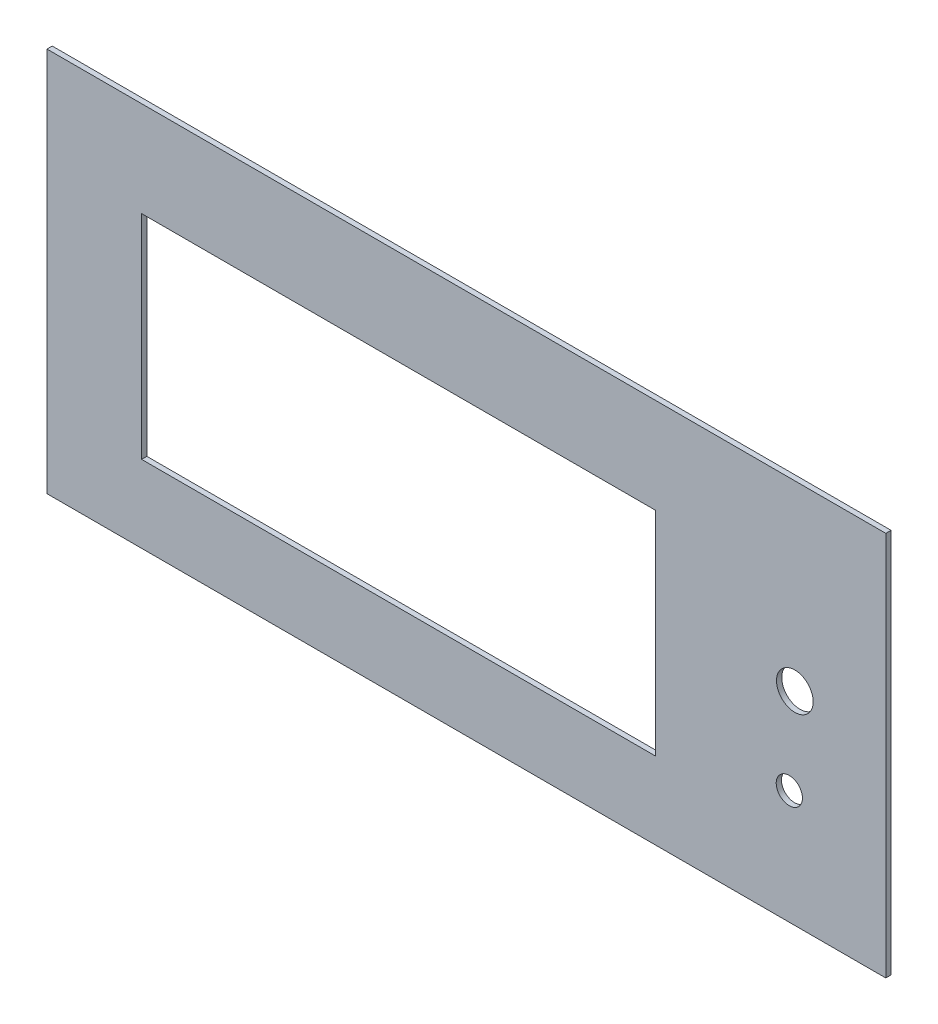
ISO-10303-21;
HEADER;
FILE_DESCRIPTION(('STEP AP214'),'2;1');
FILE_NAME('part.step','',(''),(''),'','','');
FILE_SCHEMA(('AUTOMOTIVE_DESIGN { 1 0 10303 214 1 1 1 1 }'));
ENDSEC;
DATA;
#1=APPLICATION_CONTEXT('core data for automotive mechanical design processes');
#2=APPLICATION_PROTOCOL_DEFINITION('international standard','automotive_design',2000,#1);
#3=PRODUCT_CONTEXT('',#1,'mechanical');
#4=PRODUCT('Part','Part','',(#3));
#5=PRODUCT_RELATED_PRODUCT_CATEGORY('part','',(#4));
#6=PRODUCT_DEFINITION_FORMATION('','',#4);
#7=PRODUCT_DEFINITION_CONTEXT('part definition',#1,'design');
#8=PRODUCT_DEFINITION('design','',#6,#7);
#9=PRODUCT_DEFINITION_SHAPE('','',#8);
#10=(LENGTH_UNIT() NAMED_UNIT(*) SI_UNIT(.MILLI.,.METRE.));
#11=(NAMED_UNIT(*) PLANE_ANGLE_UNIT() SI_UNIT($,.RADIAN.));
#12=(NAMED_UNIT(*) SI_UNIT($,.STERADIAN.) SOLID_ANGLE_UNIT());
#13=UNCERTAINTY_MEASURE_WITH_UNIT(LENGTH_MEASURE(1.E-05),#10,'distance_accuracy_value','');
#14=(GEOMETRIC_REPRESENTATION_CONTEXT(3) GLOBAL_UNCERTAINTY_ASSIGNED_CONTEXT((#13)) GLOBAL_UNIT_ASSIGNED_CONTEXT((#10,
#11,#12)) REPRESENTATION_CONTEXT('',''));
#15=CARTESIAN_POINT('',(0.,0.,0.));
#16=DIRECTION('',(0.,0.,1.));
#17=DIRECTION('',(1.,0.,0.));
#18=AXIS2_PLACEMENT_3D('',#15,#16,#17);
#19=CARTESIAN_POINT('',(0.,0.,1.));
#20=DIRECTION('',(0.,0.,1.));
#21=DIRECTION('',(1.,0.,0.));
#22=AXIS2_PLACEMENT_3D('',#19,#20,#21);
#23=PLANE('',#22);
#24=CARTESIAN_POINT('',(62.146139268792,-19.245198342134,1.));
#25=DIRECTION('',(0.,0.,1.));
#26=DIRECTION('',(1.,0.,0.));
#27=AXIS2_PLACEMENT_3D('',#24,#25,#26);
#28=CIRCLE('',#27,2.5);
#29=CARTESIAN_POINT('',(64.646139268792,-19.245198342134,1.));
#30=VERTEX_POINT('',#29);
#31=EDGE_CURVE('E145',#30,#30,#28,.T.);
#32=ORIENTED_EDGE('',*,*,#31,.F.);
#33=EDGE_LOOP('',(#32));
#34=FACE_BOUND('',#33,.T.);
#35=DIRECTION('',(0.,-1.,0.));
#36=VECTOR('',#35,1.);
#37=CARTESIAN_POINT('',(-79.453860731208,32.454801657866,1.));
#38=LINE('',#37,#36);
#39=CARTESIAN_POINT('',(-79.453860731208,32.454801657866,1.));
#40=VERTEX_POINT('',#39);
#41=CARTESIAN_POINT('',(-79.453860731208,-41.,1.));
#42=VERTEX_POINT('',#41);
#43=EDGE_CURVE('E155',#40,#42,#38,.T.);
#44=ORIENTED_EDGE('',*,*,#43,.T.);
#45=DIRECTION('',(1.,0.,0.));
#46=VECTOR('',#45,1.);
#47=CARTESIAN_POINT('',(-79.453860731208,-41.,1.));
#48=LINE('',#47,#46);
#49=CARTESIAN_POINT('',(80.546139268792,-41.,1.));
#50=VERTEX_POINT('',#49);
#51=EDGE_CURVE('E158',#42,#50,#48,.T.);
#52=ORIENTED_EDGE('',*,*,#51,.T.);
#53=DIRECTION('',(0.,1.,0.));
#54=VECTOR('',#53,1.);
#55=CARTESIAN_POINT('',(80.546139268792,-41.,1.));
#56=LINE('',#55,#54);
#57=CARTESIAN_POINT('',(80.546139268792,32.454801657866,1.));
#58=VERTEX_POINT('',#57);
#59=EDGE_CURVE('E161',#50,#58,#56,.T.);
#60=ORIENTED_EDGE('',*,*,#59,.T.);
#61=DIRECTION('',(-1.,0.,0.));
#62=VECTOR('',#61,1.);
#63=CARTESIAN_POINT('',(80.546139268792,32.454801657866,1.));
#64=LINE('',#63,#62);
#65=EDGE_CURVE('E163',#58,#40,#64,.T.);
#66=ORIENTED_EDGE('',*,*,#65,.T.);
#67=EDGE_LOOP('',(#44,#52,#60,#66));
#68=FACE_BOUND('',#67,.T.);
#69=DIRECTION('',(1.,0.,0.));
#70=VECTOR('',#69,1.);
#71=CARTESIAN_POINT('',(-61.4,-26.3,1.));
#72=LINE('',#71,#70);
#73=CARTESIAN_POINT('',(-61.4,-26.3,1.));
#74=VERTEX_POINT('',#73);
#75=CARTESIAN_POINT('',(36.6,-26.3,1.));
#76=VERTEX_POINT('',#75);
#77=EDGE_CURVE('E124',#74,#76,#72,.T.);
#78=ORIENTED_EDGE('',*,*,#77,.F.);
#79=DIRECTION('',(0.,-1.,0.));
#80=VECTOR('',#79,1.);
#81=CARTESIAN_POINT('',(-61.4,14.3,1.));
#82=LINE('',#81,#80);
#83=CARTESIAN_POINT('',(-61.4,14.3,1.));
#84=VERTEX_POINT('',#83);
#85=EDGE_CURVE('E116',#84,#74,#82,.T.);
#86=ORIENTED_EDGE('',*,*,#85,.F.);
#87=DIRECTION('',(-1.,0.,0.));
#88=VECTOR('',#87,1.);
#89=CARTESIAN_POINT('',(36.6,14.3,1.));
#90=LINE('',#89,#88);
#91=CARTESIAN_POINT('',(36.6,14.3,1.));
#92=VERTEX_POINT('',#91);
#93=EDGE_CURVE('E139',#92,#84,#90,.T.);
#94=ORIENTED_EDGE('',*,*,#93,.F.);
#95=DIRECTION('',(0.,1.,0.));
#96=VECTOR('',#95,1.);
#97=CARTESIAN_POINT('',(36.6,-26.3,1.));
#98=LINE('',#97,#96);
#99=EDGE_CURVE('E137',#76,#92,#98,.T.);
#100=ORIENTED_EDGE('',*,*,#99,.F.);
#101=EDGE_LOOP('',(#78,#86,#94,#100));
#102=FACE_BOUND('',#101,.T.);
#103=CARTESIAN_POINT('',(63.196139268792,-2.295198342134,1.));
#104=DIRECTION('',(0.,0.,1.));
#105=DIRECTION('',(1.,0.,0.));
#106=AXIS2_PLACEMENT_3D('',#103,#104,#105);
#107=CIRCLE('',#106,3.50000000000001);
#108=CARTESIAN_POINT('',(66.696139268792,-2.295198342134,1.));
#109=VERTEX_POINT('',#108);
#110=EDGE_CURVE('E245',#109,#109,#107,.T.);
#111=ORIENTED_EDGE('',*,*,#110,.F.);
#112=EDGE_LOOP('',(#111));
#113=FACE_BOUND('',#112,.T.);
#114=ADVANCED_FACE('F51',(#34,#68,#102,#113),#23,.T.);
#115=CARTESIAN_POINT('',(0.,0.,0.));
#116=DIRECTION('',(0.,0.,1.));
#117=DIRECTION('',(1.,0.,0.));
#118=AXIS2_PLACEMENT_3D('',#115,#116,#117);
#119=PLANE('',#118);
#120=DIRECTION('',(0.,-1.,0.));
#121=VECTOR('',#120,1.);
#122=CARTESIAN_POINT('',(-79.453860731208,32.454801657866,0.));
#123=LINE('',#122,#121);
#124=CARTESIAN_POINT('',(-79.453860731208,32.454801657866,0.));
#125=VERTEX_POINT('',#124);
#126=CARTESIAN_POINT('',(-79.453860731208,-41.,0.));
#127=VERTEX_POINT('',#126);
#128=EDGE_CURVE('E132',#125,#127,#123,.T.);
#129=ORIENTED_EDGE('',*,*,#128,.F.);
#130=DIRECTION('',(-1.,0.,0.));
#131=VECTOR('',#130,1.);
#132=CARTESIAN_POINT('',(80.546139268792,32.454801657866,0.));
#133=LINE('',#132,#131);
#134=CARTESIAN_POINT('',(80.546139268792,32.454801657866,0.));
#135=VERTEX_POINT('',#134);
#136=EDGE_CURVE('E159',#135,#125,#133,.T.);
#137=ORIENTED_EDGE('',*,*,#136,.F.);
#138=DIRECTION('',(0.,1.,0.));
#139=VECTOR('',#138,1.);
#140=CARTESIAN_POINT('',(80.546139268792,-41.,0.));
#141=LINE('',#140,#139);
#142=CARTESIAN_POINT('',(80.546139268792,-41.,0.));
#143=VERTEX_POINT('',#142);
#144=EDGE_CURVE('E170',#143,#135,#141,.T.);
#145=ORIENTED_EDGE('',*,*,#144,.F.);
#146=DIRECTION('',(1.,0.,0.));
#147=VECTOR('',#146,1.);
#148=CARTESIAN_POINT('',(-79.453860731208,-41.,0.));
#149=LINE('',#148,#147);
#150=EDGE_CURVE('E168',#127,#143,#149,.T.);
#151=ORIENTED_EDGE('',*,*,#150,.F.);
#152=EDGE_LOOP('',(#129,#137,#145,#151));
#153=FACE_BOUND('',#152,.T.);
#154=DIRECTION('',(0.,-1.,0.));
#155=VECTOR('',#154,1.);
#156=CARTESIAN_POINT('',(-61.4,14.3,0.));
#157=LINE('',#156,#155);
#158=CARTESIAN_POINT('',(-61.4,14.3,0.));
#159=VERTEX_POINT('',#158);
#160=CARTESIAN_POINT('',(-61.4,-26.3,0.));
#161=VERTEX_POINT('',#160);
#162=EDGE_CURVE('E74',#159,#161,#157,.T.);
#163=ORIENTED_EDGE('',*,*,#162,.T.);
#164=DIRECTION('',(1.,0.,0.));
#165=VECTOR('',#164,1.);
#166=CARTESIAN_POINT('',(-61.4,-26.3,0.));
#167=LINE('',#166,#165);
#168=CARTESIAN_POINT('',(36.6,-26.3,0.));
#169=VERTEX_POINT('',#168);
#170=EDGE_CURVE('E131',#161,#169,#167,.T.);
#171=ORIENTED_EDGE('',*,*,#170,.T.);
#172=DIRECTION('',(0.,1.,0.));
#173=VECTOR('',#172,1.);
#174=CARTESIAN_POINT('',(36.6,-26.3,0.));
#175=LINE('',#174,#173);
#176=CARTESIAN_POINT('',(36.6,14.3,0.));
#177=VERTEX_POINT('',#176);
#178=EDGE_CURVE('E147',#169,#177,#175,.T.);
#179=ORIENTED_EDGE('',*,*,#178,.T.);
#180=DIRECTION('',(-1.,0.,0.));
#181=VECTOR('',#180,1.);
#182=CARTESIAN_POINT('',(36.6,14.3,0.));
#183=LINE('',#182,#181);
#184=EDGE_CURVE('E125',#177,#159,#183,.T.);
#185=ORIENTED_EDGE('',*,*,#184,.T.);
#186=EDGE_LOOP('',(#163,#171,#179,#185));
#187=FACE_BOUND('',#186,.T.);
#188=CARTESIAN_POINT('',(62.146139268792,-19.245198342134,0.));
#189=DIRECTION('',(0.,0.,1.));
#190=DIRECTION('',(1.,0.,0.));
#191=AXIS2_PLACEMENT_3D('',#188,#189,#190);
#192=CIRCLE('',#191,2.5);
#193=CARTESIAN_POINT('',(64.646139268792,-19.245198342134,0.));
#194=VERTEX_POINT('',#193);
#195=EDGE_CURVE('E251',#194,#194,#192,.T.);
#196=ORIENTED_EDGE('',*,*,#195,.T.);
#197=EDGE_LOOP('',(#196));
#198=FACE_BOUND('',#197,.T.);
#199=CARTESIAN_POINT('',(63.196139268792,-2.295198342134,0.));
#200=DIRECTION('',(0.,0.,1.));
#201=DIRECTION('',(1.,0.,0.));
#202=AXIS2_PLACEMENT_3D('',#199,#200,#201);
#203=CIRCLE('',#202,3.50000000000001);
#204=CARTESIAN_POINT('',(66.696139268792,-2.295198342134,0.));
#205=VERTEX_POINT('',#204);
#206=EDGE_CURVE('E248',#205,#205,#203,.T.);
#207=ORIENTED_EDGE('',*,*,#206,.T.);
#208=EDGE_LOOP('',(#207));
#209=FACE_BOUND('',#208,.T.);
#210=ADVANCED_FACE('F188',(#153,#187,#198,#209),#119,.F.);
#211=CARTESIAN_POINT('',(-79.453860731208,32.454801657866,1.));
#212=DIRECTION('',(1.,0.,0.));
#213=DIRECTION('',(0.,1.,0.));
#214=AXIS2_PLACEMENT_3D('',#211,#212,#213);
#215=PLANE('',#214);
#216=ORIENTED_EDGE('',*,*,#128,.T.);
#217=DIRECTION('',(0.,0.,-1.));
#218=VECTOR('',#217,1.);
#219=CARTESIAN_POINT('',(-79.453860731208,-41.,1.));
#220=LINE('',#219,#218);
#221=EDGE_CURVE('E11',#42,#127,#220,.T.);
#222=ORIENTED_EDGE('',*,*,#221,.F.);
#223=ORIENTED_EDGE('',*,*,#43,.F.);
#224=DIRECTION('',(0.,0.,-1.));
#225=VECTOR('',#224,1.);
#226=CARTESIAN_POINT('',(-79.453860731208,32.454801657866,1.));
#227=LINE('',#226,#225);
#228=EDGE_CURVE('E165',#40,#125,#227,.T.);
#229=ORIENTED_EDGE('',*,*,#228,.T.);
#230=EDGE_LOOP('',(#216,#222,#223,#229));
#231=FACE_BOUND('',#230,.T.);
#232=ADVANCED_FACE('F53',(#231),#215,.F.);
#233=CARTESIAN_POINT('',(-79.453860731208,-41.,1.));
#234=DIRECTION('',(0.,1.,0.));
#235=DIRECTION('',(0.,0.,1.));
#236=AXIS2_PLACEMENT_3D('',#233,#234,#235);
#237=PLANE('',#236);
#238=ORIENTED_EDGE('',*,*,#150,.T.);
#239=DIRECTION('',(0.,0.,-1.));
#240=VECTOR('',#239,1.);
#241=CARTESIAN_POINT('',(80.546139268792,-41.,1.));
#242=LINE('',#241,#240);
#243=EDGE_CURVE('E59',#50,#143,#242,.T.);
#244=ORIENTED_EDGE('',*,*,#243,.F.);
#245=ORIENTED_EDGE('',*,*,#51,.F.);
#246=ORIENTED_EDGE('',*,*,#221,.T.);
#247=EDGE_LOOP('',(#238,#244,#245,#246));
#248=FACE_BOUND('',#247,.T.);
#249=ADVANCED_FACE('F198',(#248),#237,.F.);
#250=CARTESIAN_POINT('',(80.546139268792,-41.,1.));
#251=DIRECTION('',(-1.,0.,0.));
#252=DIRECTION('',(0.,-1.,0.));
#253=AXIS2_PLACEMENT_3D('',#250,#251,#252);
#254=PLANE('',#253);
#255=ORIENTED_EDGE('',*,*,#144,.T.);
#256=DIRECTION('',(0.,0.,-1.));
#257=VECTOR('',#256,1.);
#258=CARTESIAN_POINT('',(80.546139268792,32.454801657866,1.));
#259=LINE('',#258,#257);
#260=EDGE_CURVE('E175',#58,#135,#259,.T.);
#261=ORIENTED_EDGE('',*,*,#260,.F.);
#262=ORIENTED_EDGE('',*,*,#59,.F.);
#263=ORIENTED_EDGE('',*,*,#243,.T.);
#264=EDGE_LOOP('',(#255,#261,#262,#263));
#265=FACE_BOUND('',#264,.T.);
#266=ADVANCED_FACE('F182',(#265),#254,.F.);
#267=CARTESIAN_POINT('',(80.546139268792,32.454801657866,1.));
#268=DIRECTION('',(0.,-1.,0.));
#269=DIRECTION('',(0.,0.,-1.));
#270=AXIS2_PLACEMENT_3D('',#267,#268,#269);
#271=PLANE('',#270);
#272=ORIENTED_EDGE('',*,*,#136,.T.);
#273=ORIENTED_EDGE('',*,*,#228,.F.);
#274=ORIENTED_EDGE('',*,*,#65,.F.);
#275=ORIENTED_EDGE('',*,*,#260,.T.);
#276=EDGE_LOOP('',(#272,#273,#274,#275));
#277=FACE_BOUND('',#276,.T.);
#278=ADVANCED_FACE('F192',(#277),#271,.F.);
#279=CARTESIAN_POINT('',(-61.4,14.3,1.));
#280=DIRECTION('',(1.,0.,0.));
#281=DIRECTION('',(0.,1.,0.));
#282=AXIS2_PLACEMENT_3D('',#279,#280,#281);
#283=PLANE('',#282);
#284=ORIENTED_EDGE('',*,*,#162,.F.);
#285=DIRECTION('',(0.,0.,-1.));
#286=VECTOR('',#285,1.);
#287=CARTESIAN_POINT('',(-61.4,14.3,1.));
#288=LINE('',#287,#286);
#289=EDGE_CURVE('E120',#84,#159,#288,.T.);
#290=ORIENTED_EDGE('',*,*,#289,.F.);
#291=ORIENTED_EDGE('',*,*,#85,.T.);
#292=DIRECTION('',(0.,0.,-1.));
#293=VECTOR('',#292,1.);
#294=CARTESIAN_POINT('',(-61.4,-26.3,1.));
#295=LINE('',#294,#293);
#296=EDGE_CURVE('E119',#74,#161,#295,.T.);
#297=ORIENTED_EDGE('',*,*,#296,.T.);
#298=EDGE_LOOP('',(#284,#290,#291,#297));
#299=FACE_BOUND('',#298,.T.);
#300=ADVANCED_FACE('F118',(#299),#283,.T.);
#301=CARTESIAN_POINT('',(-61.4,-26.3,1.));
#302=DIRECTION('',(0.,1.,0.));
#303=DIRECTION('',(0.,0.,1.));
#304=AXIS2_PLACEMENT_3D('',#301,#302,#303);
#305=PLANE('',#304);
#306=ORIENTED_EDGE('',*,*,#170,.F.);
#307=ORIENTED_EDGE('',*,*,#296,.F.);
#308=ORIENTED_EDGE('',*,*,#77,.T.);
#309=DIRECTION('',(0.,0.,-1.));
#310=VECTOR('',#309,1.);
#311=CARTESIAN_POINT('',(36.6,-26.3,1.));
#312=LINE('',#311,#310);
#313=EDGE_CURVE('E133',#76,#169,#312,.T.);
#314=ORIENTED_EDGE('',*,*,#313,.T.);
#315=EDGE_LOOP('',(#306,#307,#308,#314));
#316=FACE_BOUND('',#315,.T.);
#317=ADVANCED_FACE('F128',(#316),#305,.T.);
#318=CARTESIAN_POINT('',(36.6,-26.3,1.));
#319=DIRECTION('',(-1.,0.,0.));
#320=DIRECTION('',(0.,-1.,0.));
#321=AXIS2_PLACEMENT_3D('',#318,#319,#320);
#322=PLANE('',#321);
#323=ORIENTED_EDGE('',*,*,#178,.F.);
#324=ORIENTED_EDGE('',*,*,#313,.F.);
#325=ORIENTED_EDGE('',*,*,#99,.T.);
#326=DIRECTION('',(0.,0.,-1.));
#327=VECTOR('',#326,1.);
#328=CARTESIAN_POINT('',(36.6,14.3,1.));
#329=LINE('',#328,#327);
#330=EDGE_CURVE('E66',#92,#177,#329,.T.);
#331=ORIENTED_EDGE('',*,*,#330,.T.);
#332=EDGE_LOOP('',(#323,#324,#325,#331));
#333=FACE_BOUND('',#332,.T.);
#334=ADVANCED_FACE('F223',(#333),#322,.T.);
#335=CARTESIAN_POINT('',(36.6,14.3,1.));
#336=DIRECTION('',(0.,-1.,0.));
#337=DIRECTION('',(0.,0.,-1.));
#338=AXIS2_PLACEMENT_3D('',#335,#336,#337);
#339=PLANE('',#338);
#340=ORIENTED_EDGE('',*,*,#184,.F.);
#341=ORIENTED_EDGE('',*,*,#330,.F.);
#342=ORIENTED_EDGE('',*,*,#93,.T.);
#343=ORIENTED_EDGE('',*,*,#289,.T.);
#344=EDGE_LOOP('',(#340,#341,#342,#343));
#345=FACE_BOUND('',#344,.T.);
#346=ADVANCED_FACE('F227',(#345),#339,.T.);
#347=CARTESIAN_POINT('',(62.146139268792,-19.245198342134,1.));
#348=DIRECTION('',(0.,0.,-1.));
#349=DIRECTION('',(-1.,0.,0.));
#350=AXIS2_PLACEMENT_3D('',#347,#348,#349);
#351=CYLINDRICAL_SURFACE('',#350,2.5);
#352=ORIENTED_EDGE('',*,*,#31,.T.);
#353=EDGE_LOOP('',(#352));
#354=FACE_BOUND('',#353,.T.);
#355=ORIENTED_EDGE('',*,*,#195,.F.);
#356=EDGE_LOOP('',(#355));
#357=FACE_BOUND('',#356,.T.);
#358=ADVANCED_FACE('F233',(#354,#357),#351,.F.);
#359=CARTESIAN_POINT('',(63.196139268792,-2.295198342134,1.));
#360=DIRECTION('',(0.,0.,-1.));
#361=DIRECTION('',(-1.,0.,0.));
#362=AXIS2_PLACEMENT_3D('',#359,#360,#361);
#363=CYLINDRICAL_SURFACE('',#362,3.50000000000001);
#364=ORIENTED_EDGE('',*,*,#110,.T.);
#365=EDGE_LOOP('',(#364));
#366=FACE_BOUND('',#365,.T.);
#367=ORIENTED_EDGE('',*,*,#206,.F.);
#368=EDGE_LOOP('',(#367));
#369=FACE_BOUND('',#368,.T.);
#370=ADVANCED_FACE('F236',(#366,#369),#363,.F.);
#371=CLOSED_SHELL('',(#114,#210,#232,#249,#266,#278,#300,#317,#334,#346,#358,#370));
#372=MANIFOLD_SOLID_BREP('B2',#371);
#373=ADVANCED_BREP_SHAPE_REPRESENTATION('',(#18,#372),#14);
#374=SHAPE_DEFINITION_REPRESENTATION(#9,#373);
ENDSEC;
END-ISO-10303-21;
